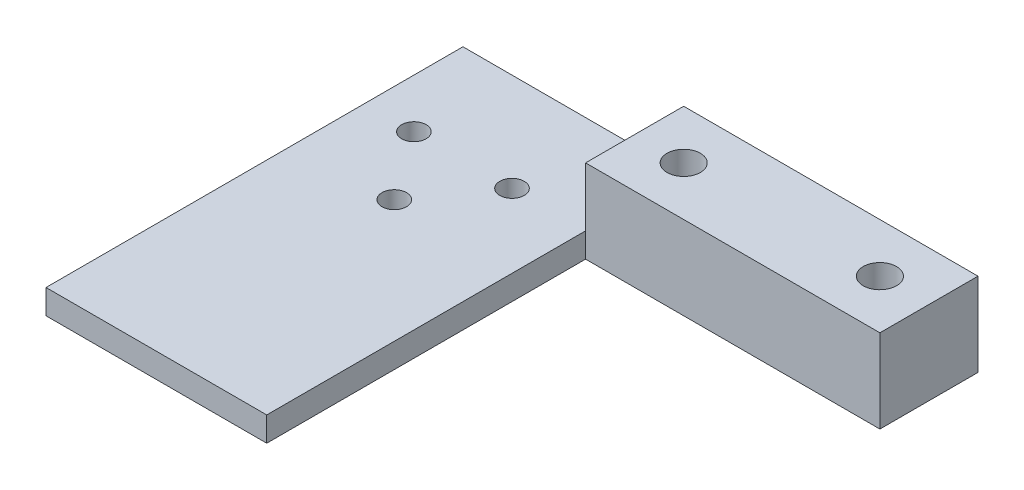
ISO-10303-21;
HEADER;
FILE_DESCRIPTION(('STEP AP214'),'2;1');
FILE_NAME('part.step','',(''),(''),'','','');
FILE_SCHEMA(('AUTOMOTIVE_DESIGN { 1 0 10303 214 1 1 1 1 }'));
ENDSEC;
DATA;
#1=APPLICATION_CONTEXT('core data for automotive mechanical design processes');
#2=APPLICATION_PROTOCOL_DEFINITION('international standard','automotive_design',2000,#1);
#3=PRODUCT_CONTEXT('',#1,'mechanical');
#4=PRODUCT('Part','Part','',(#3));
#5=PRODUCT_RELATED_PRODUCT_CATEGORY('part','',(#4));
#6=PRODUCT_DEFINITION_FORMATION('','',#4);
#7=PRODUCT_DEFINITION_CONTEXT('part definition',#1,'design');
#8=PRODUCT_DEFINITION('design','',#6,#7);
#9=PRODUCT_DEFINITION_SHAPE('','',#8);
#10=(LENGTH_UNIT() NAMED_UNIT(*) SI_UNIT(.MILLI.,.METRE.));
#11=(NAMED_UNIT(*) PLANE_ANGLE_UNIT() SI_UNIT($,.RADIAN.));
#12=(NAMED_UNIT(*) SI_UNIT($,.STERADIAN.) SOLID_ANGLE_UNIT());
#13=UNCERTAINTY_MEASURE_WITH_UNIT(LENGTH_MEASURE(1.E-05),#10,'distance_accuracy_value','');
#14=(GEOMETRIC_REPRESENTATION_CONTEXT(3) GLOBAL_UNCERTAINTY_ASSIGNED_CONTEXT((#13)) GLOBAL_UNIT_ASSIGNED_CONTEXT((#10,
#11,#12)) REPRESENTATION_CONTEXT('',''));
#15=CARTESIAN_POINT('',(0.,0.,0.));
#16=DIRECTION('',(0.,0.,1.));
#17=DIRECTION('',(1.,0.,0.));
#18=AXIS2_PLACEMENT_3D('',#15,#16,#17);
#19=CARTESIAN_POINT('',(-7.49999999999999,17.,42.5));
#20=DIRECTION('',(1.,0.,0.));
#21=DIRECTION('',(0.,0.,-1.));
#22=AXIS2_PLACEMENT_3D('',#19,#20,#21);
#23=PLANE('',#22);
#24=DIRECTION('',(0.,0.,1.));
#25=VECTOR('',#24,1.);
#26=CARTESIAN_POINT('',(-7.50000000000001,5.,0.));
#27=LINE('',#26,#25);
#28=CARTESIAN_POINT('',(-7.50000000000001,5.,-22.5000000000002));
#29=VERTEX_POINT('',#28);
#30=CARTESIAN_POINT('',(-7.50000000000001,5.,-42.5000000000002));
#31=VERTEX_POINT('',#30);
#32=EDGE_CURVE('E253',#29,#31,#27,.F.);
#33=ORIENTED_EDGE('',*,*,#32,.F.);
#34=DIRECTION('',(0.,1.,0.));
#35=VECTOR('',#34,1.);
#36=CARTESIAN_POINT('',(-7.50000000000001,0.,-22.5000000000002));
#37=LINE('',#36,#35);
#38=CARTESIAN_POINT('',(-7.50000000000001,17.,-22.5000000000002));
#39=VERTEX_POINT('',#38);
#40=EDGE_CURVE('E272',#39,#29,#37,.F.);
#41=ORIENTED_EDGE('',*,*,#40,.F.);
#42=DIRECTION('',(0.,0.,1.));
#43=VECTOR('',#42,1.);
#44=CARTESIAN_POINT('',(-7.50000000000001,17.,0.));
#45=LINE('',#44,#43);
#46=CARTESIAN_POINT('',(-7.50000000000001,17.,-42.5000000000002));
#47=VERTEX_POINT('',#46);
#48=EDGE_CURVE('E136',#47,#39,#45,.T.);
#49=ORIENTED_EDGE('',*,*,#48,.F.);
#50=DIRECTION('',(0.,1.,0.));
#51=VECTOR('',#50,1.);
#52=CARTESIAN_POINT('',(-7.50000000000001,0.,-42.5000000000002));
#53=LINE('',#52,#51);
#54=EDGE_CURVE('E279',#31,#47,#53,.T.);
#55=ORIENTED_EDGE('',*,*,#54,.F.);
#56=EDGE_LOOP('',(#33,#41,#49,#55));
#57=FACE_BOUND('',#56,.T.);
#58=ADVANCED_FACE('F16',(#57),#23,.F.);
#59=CARTESIAN_POINT('',(0.,17.,0.));
#60=DIRECTION('',(0.,1.,0.));
#61=DIRECTION('',(0.,0.,1.));
#62=AXIS2_PLACEMENT_3D('',#59,#60,#61);
#63=PLANE('',#62);
#64=CARTESIAN_POINT('',(2.5,17.,-32.5000000000002));
#65=DIRECTION('',(0.,1.,0.));
#66=DIRECTION('',(0.,0.,1.));
#67=AXIS2_PLACEMENT_3D('',#64,#65,#66);
#68=CIRCLE('',#67,3.4);
#69=CARTESIAN_POINT('',(2.5,17.,-29.1000000000002));
#70=VERTEX_POINT('',#69);
#71=EDGE_CURVE('E118',#70,#70,#68,.F.);
#72=ORIENTED_EDGE('',*,*,#71,.T.);
#73=EDGE_LOOP('',(#72));
#74=FACE_BOUND('',#73,.T.);
#75=CARTESIAN_POINT('',(42.5,17.,-32.5000000000002));
#76=DIRECTION('',(0.,1.,0.));
#77=DIRECTION('',(0.,0.,1.));
#78=AXIS2_PLACEMENT_3D('',#75,#76,#77);
#79=CIRCLE('',#78,3.4);
#80=CARTESIAN_POINT('',(42.5,17.,-29.1000000000002));
#81=VERTEX_POINT('',#80);
#82=EDGE_CURVE('E19',#81,#81,#79,.F.);
#83=ORIENTED_EDGE('',*,*,#82,.T.);
#84=EDGE_LOOP('',(#83));
#85=FACE_BOUND('',#84,.T.);
#86=DIRECTION('',(-1.,0.,0.));
#87=VECTOR('',#86,1.);
#88=CARTESIAN_POINT('',(52.5,17.,-42.5));
#89=LINE('',#88,#87);
#90=CARTESIAN_POINT('',(52.5,17.,-42.5));
#91=VERTEX_POINT('',#90);
#92=EDGE_CURVE('E281',#47,#91,#89,.F.);
#93=ORIENTED_EDGE('',*,*,#92,.F.);
#94=ORIENTED_EDGE('',*,*,#48,.T.);
#95=DIRECTION('',(1.,0.,0.));
#96=VECTOR('',#95,1.);
#97=CARTESIAN_POINT('',(-7.50000000000001,17.,-22.5000000000002));
#98=LINE('',#97,#96);
#99=CARTESIAN_POINT('',(52.5,17.,-22.5));
#100=VERTEX_POINT('',#99);
#101=EDGE_CURVE('E269',#100,#39,#98,.F.);
#102=ORIENTED_EDGE('',*,*,#101,.F.);
#103=DIRECTION('',(0.,0.,-1.));
#104=VECTOR('',#103,1.);
#105=CARTESIAN_POINT('',(52.5,17.,-22.5));
#106=LINE('',#105,#104);
#107=EDGE_CURVE('E275',#91,#100,#106,.F.);
#108=ORIENTED_EDGE('',*,*,#107,.F.);
#109=EDGE_LOOP('',(#93,#94,#102,#108));
#110=FACE_BOUND('',#109,.T.);
#111=ADVANCED_FACE('F165',(#74,#85,#110),#63,.T.);
#112=CARTESIAN_POINT('',(42.5,-0.895072409927977,-32.5000000000002));
#113=DIRECTION('',(0.,1.,0.));
#114=DIRECTION('',(0.,0.,1.));
#115=AXIS2_PLACEMENT_3D('',#112,#113,#114);
#116=CYLINDRICAL_SURFACE('',#115,3.4);
#117=CARTESIAN_POINT('',(42.5,2.00000000000955,-32.5000000000002));
#118=DIRECTION('',(0.,1.,0.));
#119=DIRECTION('',(0.,0.,-1.));
#120=AXIS2_PLACEMENT_3D('',#117,#118,#119);
#121=CIRCLE('',#120,3.40000000002647);
#122=CARTESIAN_POINT('',(45.8999999999755,1.99999999998823,-32.5));
#123=VERTEX_POINT('',#122);
#124=CARTESIAN_POINT('',(39.1000000000194,1.99999999999295,-32.5000000000002));
#125=VERTEX_POINT('',#124);
#126=EDGE_CURVE('E122',#123,#125,#121,.F.);
#127=ORIENTED_EDGE('',*,*,#126,.T.);
#128=CARTESIAN_POINT('',(42.5,2.00000000000955,-32.5000000000002));
#129=DIRECTION('',(0.,1.,0.));
#130=DIRECTION('',(0.,0.,1.));
#131=AXIS2_PLACEMENT_3D('',#128,#129,#130);
#132=CIRCLE('',#131,3.39999999991505);
#133=EDGE_CURVE('E111',#125,#123,#132,.F.);
#134=ORIENTED_EDGE('',*,*,#133,.T.);
#135=EDGE_LOOP('',(#127,#134));
#136=FACE_BOUND('',#135,.T.);
#137=ORIENTED_EDGE('',*,*,#82,.F.);
#138=EDGE_LOOP('',(#137));
#139=FACE_BOUND('',#138,.T.);
#140=ADVANCED_FACE('F126',(#136,#139),#116,.F.);
#141=CARTESIAN_POINT('',(42.5,1.99999999995271,-32.5000000000002));
#142=DIRECTION('',(0.,1.,0.));
#143=DIRECTION('',(0.,0.,1.));
#144=AXIS2_PLACEMENT_3D('',#141,#142,#143);
#145=CONICAL_SURFACE('',#144,3.39999999985821,1.02974425867836);
#146=ORIENTED_EDGE('',*,*,#133,.F.);
#147=DIRECTION('',(0.857167300703852,-0.515038074907159,0.));
#148=VECTOR('',#147,1.);
#149=CARTESIAN_POINT('',(-498925.,299809.877996235,-32.5000000000307));
#150=LINE('',#149,#148);
#151=CARTESIAN_POINT('',(42.4285589646399,4.31321645066873E-11,-32.5000000000002));
#152=VERTEX_POINT('',#151);
#153=EDGE_CURVE('E115',#125,#152,#150,.T.);
#154=ORIENTED_EDGE('',*,*,#153,.T.);
#155=CARTESIAN_POINT('',(42.5,5.7065463465733E-11,-32.5000000000002));
#156=DIRECTION('',(0.,1.,0.));
#157=DIRECTION('',(0.,0.,1.));
#158=AXIS2_PLACEMENT_3D('',#155,#156,#157);
#159=CIRCLE('',#158,0.0714410353180039);
#160=CARTESIAN_POINT('',(42.5714410353316,4.31321645066873E-11,-32.5000000000002));
#161=VERTEX_POINT('',#160);
#162=EDGE_CURVE('E46',#161,#152,#159,.T.);
#163=ORIENTED_EDGE('',*,*,#162,.F.);
#164=DIRECTION('',(-0.857167300703852,-0.515038074907159,0.));
#165=VECTOR('',#164,1.);
#166=CARTESIAN_POINT('',(499010.,299809.877996235,-32.4999999999085));
#167=LINE('',#166,#165);
#168=EDGE_CURVE('E117',#161,#123,#167,.F.);
#169=ORIENTED_EDGE('',*,*,#168,.T.);
#170=EDGE_LOOP('',(#146,#154,#163,#169));
#171=FACE_BOUND('',#170,.T.);
#172=ADVANCED_FACE('F114',(#171),#145,.F.);
#173=CARTESIAN_POINT('',(2.5,-0.895072409927977,-32.5000000000002));
#174=DIRECTION('',(0.,1.,0.));
#175=DIRECTION('',(0.,0.,1.));
#176=AXIS2_PLACEMENT_3D('',#173,#174,#175);
#177=CYLINDRICAL_SURFACE('',#176,3.4);
#178=CARTESIAN_POINT('',(2.5,2.00000000000955,-32.5000000000002));
#179=DIRECTION('',(0.,1.,0.));
#180=DIRECTION('',(0.,0.,-1.));
#181=AXIS2_PLACEMENT_3D('',#178,#179,#180);
#182=CIRCLE('',#181,3.40000000002647);
#183=CARTESIAN_POINT('',(5.89999999998461,1.99999999998823,-32.5000000000002));
#184=VERTEX_POINT('',#183);
#185=CARTESIAN_POINT('',(-0.899999999971535,1.99999999999295,-32.5000000000002));
#186=VERTEX_POINT('',#185);
#187=EDGE_CURVE('E241',#184,#186,#182,.F.);
#188=ORIENTED_EDGE('',*,*,#187,.T.);
#189=CARTESIAN_POINT('',(2.5,2.00000000000955,-32.5000000000002));
#190=DIRECTION('',(0.,1.,0.));
#191=DIRECTION('',(0.,0.,1.));
#192=AXIS2_PLACEMENT_3D('',#189,#190,#191);
#193=CIRCLE('',#192,3.39999999991505);
#194=EDGE_CURVE('E160',#186,#184,#193,.F.);
#195=ORIENTED_EDGE('',*,*,#194,.T.);
#196=EDGE_LOOP('',(#188,#195));
#197=FACE_BOUND('',#196,.T.);
#198=ORIENTED_EDGE('',*,*,#71,.F.);
#199=EDGE_LOOP('',(#198));
#200=FACE_BOUND('',#199,.T.);
#201=ADVANCED_FACE('F174',(#197,#200),#177,.F.);
#202=CARTESIAN_POINT('',(2.5,1.99999999995271,-32.5000000000002));
#203=DIRECTION('',(0.,1.,0.));
#204=DIRECTION('',(0.,0.,1.));
#205=AXIS2_PLACEMENT_3D('',#202,#203,#204);
#206=CONICAL_SURFACE('',#205,3.39999999985821,1.02974425867836);
#207=ORIENTED_EDGE('',*,*,#194,.F.);
#208=DIRECTION('',(0.857167300703852,-0.515038074907159,0.));
#209=VECTOR('',#208,1.);
#210=CARTESIAN_POINT('',(-498965.,299809.877996235,-32.5000000000307));
#211=LINE('',#210,#209);
#212=CARTESIAN_POINT('',(2.42855896471156,2.60902410786912E-11,-32.5000000000002));
#213=VERTEX_POINT('',#212);
#214=EDGE_CURVE('E158',#186,#213,#211,.T.);
#215=ORIENTED_EDGE('',*,*,#214,.T.);
#216=CARTESIAN_POINT('',(2.5,5.7065463465733E-11,-32.5000000000002));
#217=DIRECTION('',(0.,1.,0.));
#218=DIRECTION('',(0.,0.,1.));
#219=AXIS2_PLACEMENT_3D('',#216,#217,#218);
#220=CIRCLE('',#219,0.0714410353180039);
#221=CARTESIAN_POINT('',(2.57144103534529,2.60902410786912E-11,-32.5000000000002));
#222=VERTEX_POINT('',#221);
#223=EDGE_CURVE('E34',#222,#213,#220,.T.);
#224=ORIENTED_EDGE('',*,*,#223,.F.);
#225=DIRECTION('',(-0.857167300703852,-0.515038074907159,0.));
#226=VECTOR('',#225,1.);
#227=CARTESIAN_POINT('',(498970.,299809.877996235,-32.4999999999085));
#228=LINE('',#227,#226);
#229=EDGE_CURVE('E124',#222,#184,#228,.F.);
#230=ORIENTED_EDGE('',*,*,#229,.T.);
#231=EDGE_LOOP('',(#207,#215,#224,#230));
#232=FACE_BOUND('',#231,.T.);
#233=ADVANCED_FACE('F230',(#232),#206,.F.);
#234=CARTESIAN_POINT('',(0.,5.,0.));
#235=DIRECTION('',(0.,1.,0.));
#236=DIRECTION('',(0.,0.,1.));
#237=AXIS2_PLACEMENT_3D('',#234,#235,#236);
#238=PLANE('',#237);
#239=CARTESIAN_POINT('',(-32.5,5.,-8.5000000000002));
#240=DIRECTION('',(0.,-1.,0.));
#241=DIRECTION('',(0.,0.,-1.));
#242=AXIS2_PLACEMENT_3D('',#239,#240,#241);
#243=CIRCLE('',#242,2.5);
#244=CARTESIAN_POINT('',(-32.5,5.,-11.0000000000002));
#245=VERTEX_POINT('',#244);
#246=EDGE_CURVE('E148',#245,#245,#243,.T.);
#247=ORIENTED_EDGE('',*,*,#246,.T.);
#248=EDGE_LOOP('',(#247));
#249=FACE_BOUND('',#248,.T.);
#250=CARTESIAN_POINT('',(-42.5,5.,-22.5));
#251=DIRECTION('',(0.,1.,0.));
#252=DIRECTION('',(0.,0.,1.));
#253=AXIS2_PLACEMENT_3D('',#250,#251,#252);
#254=CIRCLE('',#253,2.5);
#255=CARTESIAN_POINT('',(-42.5,5.,-20.));
#256=VERTEX_POINT('',#255);
#257=EDGE_CURVE('E152',#256,#256,#254,.F.);
#258=ORIENTED_EDGE('',*,*,#257,.T.);
#259=EDGE_LOOP('',(#258));
#260=FACE_BOUND('',#259,.T.);
#261=CARTESIAN_POINT('',(-22.5,5.,-22.5000000000002));
#262=DIRECTION('',(0.,1.,0.));
#263=DIRECTION('',(0.,0.,1.));
#264=AXIS2_PLACEMENT_3D('',#261,#262,#263);
#265=CIRCLE('',#264,2.5);
#266=CARTESIAN_POINT('',(-22.5,5.,-20.0000000000002));
#267=VERTEX_POINT('',#266);
#268=EDGE_CURVE('E155',#267,#267,#265,.F.);
#269=ORIENTED_EDGE('',*,*,#268,.T.);
#270=EDGE_LOOP('',(#269));
#271=FACE_BOUND('',#270,.T.);
#272=DIRECTION('',(-1.,0.,0.));
#273=VECTOR('',#272,1.);
#274=CARTESIAN_POINT('',(52.5,5.,-42.5));
#275=LINE('',#274,#273);
#276=CARTESIAN_POINT('',(-52.5,5.,-42.5000000000004));
#277=VERTEX_POINT('',#276);
#278=EDGE_CURVE('E129',#277,#31,#275,.F.);
#279=ORIENTED_EDGE('',*,*,#278,.F.);
#280=DIRECTION('',(0.,0.,1.));
#281=VECTOR('',#280,1.);
#282=CARTESIAN_POINT('',(-52.5,5.,-42.5000000000004));
#283=LINE('',#282,#281);
#284=CARTESIAN_POINT('',(-52.5,5.,42.4999999999996));
#285=VERTEX_POINT('',#284);
#286=EDGE_CURVE('E255',#285,#277,#283,.F.);
#287=ORIENTED_EDGE('',*,*,#286,.F.);
#288=DIRECTION('',(1.,0.,0.));
#289=VECTOR('',#288,1.);
#290=CARTESIAN_POINT('',(-52.5,5.,42.4999999999996));
#291=LINE('',#290,#289);
#292=CARTESIAN_POINT('',(-7.49999999999999,5.,42.5));
#293=VERTEX_POINT('',#292);
#294=EDGE_CURVE('E259',#293,#285,#291,.F.);
#295=ORIENTED_EDGE('',*,*,#294,.F.);
#296=DIRECTION('',(0.,0.,-1.));
#297=VECTOR('',#296,1.);
#298=CARTESIAN_POINT('',(-7.49999999999999,5.,42.5));
#299=LINE('',#298,#297);
#300=EDGE_CURVE('E264',#29,#293,#299,.F.);
#301=ORIENTED_EDGE('',*,*,#300,.F.);
#302=ORIENTED_EDGE('',*,*,#32,.T.);
#303=EDGE_LOOP('',(#279,#287,#295,#301,#302));
#304=FACE_BOUND('',#303,.T.);
#305=ADVANCED_FACE('F226',(#249,#260,#271,#304),#238,.T.);
#306=CARTESIAN_POINT('',(-52.5,0.,-42.5000000000004));
#307=DIRECTION('',(-1.,0.,0.));
#308=DIRECTION('',(0.,0.,1.));
#309=AXIS2_PLACEMENT_3D('',#306,#307,#308);
#310=PLANE('',#309);
#311=DIRECTION('',(0.,1.,0.));
#312=VECTOR('',#311,1.);
#313=CARTESIAN_POINT('',(-52.5,0.,42.4999999999996));
#314=LINE('',#313,#312);
#315=CARTESIAN_POINT('',(-52.5,0.,42.4999999999996));
#316=VERTEX_POINT('',#315);
#317=EDGE_CURVE('E257',#285,#316,#314,.F.);
#318=ORIENTED_EDGE('',*,*,#317,.F.);
#319=ORIENTED_EDGE('',*,*,#286,.T.);
#320=DIRECTION('',(0.,1.,0.));
#321=VECTOR('',#320,1.);
#322=CARTESIAN_POINT('',(-52.5,0.,-42.5000000000004));
#323=LINE('',#322,#321);
#324=CARTESIAN_POINT('',(-52.5,0.,-42.5000000000004));
#325=VERTEX_POINT('',#324);
#326=EDGE_CURVE('E284',#325,#277,#323,.T.);
#327=ORIENTED_EDGE('',*,*,#326,.F.);
#328=DIRECTION('',(0.,0.,1.));
#329=VECTOR('',#328,1.);
#330=CARTESIAN_POINT('',(-52.5,0.,-3.88578058618805E-13));
#331=LINE('',#330,#329);
#332=EDGE_CURVE('E151',#325,#316,#331,.T.);
#333=ORIENTED_EDGE('',*,*,#332,.T.);
#334=EDGE_LOOP('',(#318,#319,#327,#333));
#335=FACE_BOUND('',#334,.T.);
#336=ADVANCED_FACE('F222',(#335),#310,.T.);
#337=CARTESIAN_POINT('',(-52.5,0.,42.4999999999996));
#338=DIRECTION('',(0.,0.,1.));
#339=DIRECTION('',(1.,0.,0.));
#340=AXIS2_PLACEMENT_3D('',#337,#338,#339);
#341=PLANE('',#340);
#342=DIRECTION('',(0.,1.,0.));
#343=VECTOR('',#342,1.);
#344=CARTESIAN_POINT('',(-7.49999999999999,0.,42.5));
#345=LINE('',#344,#343);
#346=CARTESIAN_POINT('',(-7.49999999999999,0.,42.5));
#347=VERTEX_POINT('',#346);
#348=EDGE_CURVE('E262',#293,#347,#345,.F.);
#349=ORIENTED_EDGE('',*,*,#348,.F.);
#350=ORIENTED_EDGE('',*,*,#294,.T.);
#351=ORIENTED_EDGE('',*,*,#317,.T.);
#352=DIRECTION('',(1.,0.,0.));
#353=VECTOR('',#352,1.);
#354=CARTESIAN_POINT('',(0.,0.,42.5));
#355=LINE('',#354,#353);
#356=EDGE_CURVE('E299',#316,#347,#355,.T.);
#357=ORIENTED_EDGE('',*,*,#356,.T.);
#358=EDGE_LOOP('',(#349,#350,#351,#357));
#359=FACE_BOUND('',#358,.T.);
#360=ADVANCED_FACE('F218',(#359),#341,.T.);
#361=CARTESIAN_POINT('',(-7.49999999999999,0.,42.5));
#362=DIRECTION('',(1.,0.,0.));
#363=DIRECTION('',(0.,0.,-1.));
#364=AXIS2_PLACEMENT_3D('',#361,#362,#363);
#365=PLANE('',#364);
#366=DIRECTION('',(0.,1.,0.));
#367=VECTOR('',#366,1.);
#368=CARTESIAN_POINT('',(-7.50000000000001,0.,-22.5000000000002));
#369=LINE('',#368,#367);
#370=CARTESIAN_POINT('',(-7.50000000000001,0.,-22.5000000000002));
#371=VERTEX_POINT('',#370);
#372=EDGE_CURVE('E267',#29,#371,#369,.F.);
#373=ORIENTED_EDGE('',*,*,#372,.F.);
#374=ORIENTED_EDGE('',*,*,#300,.T.);
#375=ORIENTED_EDGE('',*,*,#348,.T.);
#376=DIRECTION('',(0.,0.,1.));
#377=VECTOR('',#376,1.);
#378=CARTESIAN_POINT('',(-7.50000000000001,0.,0.));
#379=LINE('',#378,#377);
#380=EDGE_CURVE('E302',#347,#371,#379,.F.);
#381=ORIENTED_EDGE('',*,*,#380,.T.);
#382=EDGE_LOOP('',(#373,#374,#375,#381));
#383=FACE_BOUND('',#382,.T.);
#384=ADVANCED_FACE('F214',(#383),#365,.T.);
#385=CARTESIAN_POINT('',(-7.50000000000001,0.,-22.5000000000002));
#386=DIRECTION('',(0.,0.,1.));
#387=DIRECTION('',(1.,0.,0.));
#388=AXIS2_PLACEMENT_3D('',#385,#386,#387);
#389=PLANE('',#388);
#390=ORIENTED_EDGE('',*,*,#101,.T.);
#391=ORIENTED_EDGE('',*,*,#40,.T.);
#392=ORIENTED_EDGE('',*,*,#372,.T.);
#393=DIRECTION('',(1.,0.,0.));
#394=VECTOR('',#393,1.);
#395=CARTESIAN_POINT('',(0.,0.,-22.5000000000002));
#396=LINE('',#395,#394);
#397=CARTESIAN_POINT('',(52.5,0.,-22.5));
#398=VERTEX_POINT('',#397);
#399=EDGE_CURVE('E305',#371,#398,#396,.T.);
#400=ORIENTED_EDGE('',*,*,#399,.T.);
#401=DIRECTION('',(0.,1.,0.));
#402=VECTOR('',#401,1.);
#403=CARTESIAN_POINT('',(52.5,0.,-22.5));
#404=LINE('',#403,#402);
#405=EDGE_CURVE('E277',#100,#398,#404,.F.);
#406=ORIENTED_EDGE('',*,*,#405,.F.);
#407=EDGE_LOOP('',(#390,#391,#392,#400,#406));
#408=FACE_BOUND('',#407,.T.);
#409=ADVANCED_FACE('F210',(#408),#389,.T.);
#410=CARTESIAN_POINT('',(52.5,0.,-22.5));
#411=DIRECTION('',(1.,0.,0.));
#412=DIRECTION('',(0.,0.,-1.));
#413=AXIS2_PLACEMENT_3D('',#410,#411,#412);
#414=PLANE('',#413);
#415=ORIENTED_EDGE('',*,*,#405,.T.);
#416=DIRECTION('',(0.,0.,1.));
#417=VECTOR('',#416,1.);
#418=CARTESIAN_POINT('',(52.4999999999998,0.,0.));
#419=LINE('',#418,#417);
#420=CARTESIAN_POINT('',(52.5,0.,-42.5));
#421=VERTEX_POINT('',#420);
#422=EDGE_CURVE('E308',#398,#421,#419,.F.);
#423=ORIENTED_EDGE('',*,*,#422,.T.);
#424=DIRECTION('',(0.,1.,0.));
#425=VECTOR('',#424,1.);
#426=CARTESIAN_POINT('',(52.5,0.,-42.5));
#427=LINE('',#426,#425);
#428=EDGE_CURVE('E58',#91,#421,#427,.F.);
#429=ORIENTED_EDGE('',*,*,#428,.F.);
#430=ORIENTED_EDGE('',*,*,#107,.T.);
#431=EDGE_LOOP('',(#415,#423,#429,#430));
#432=FACE_BOUND('',#431,.T.);
#433=ADVANCED_FACE('F207',(#432),#414,.T.);
#434=CARTESIAN_POINT('',(52.5,0.,-42.5));
#435=DIRECTION('',(0.,0.,-1.));
#436=DIRECTION('',(-1.,0.,0.));
#437=AXIS2_PLACEMENT_3D('',#434,#435,#436);
#438=PLANE('',#437);
#439=ORIENTED_EDGE('',*,*,#326,.T.);
#440=ORIENTED_EDGE('',*,*,#278,.T.);
#441=ORIENTED_EDGE('',*,*,#54,.T.);
#442=ORIENTED_EDGE('',*,*,#92,.T.);
#443=ORIENTED_EDGE('',*,*,#428,.T.);
#444=DIRECTION('',(1.,0.,0.));
#445=VECTOR('',#444,1.);
#446=CARTESIAN_POINT('',(0.,0.,-42.5000000000002));
#447=LINE('',#446,#445);
#448=EDGE_CURVE('E147',#421,#325,#447,.F.);
#449=ORIENTED_EDGE('',*,*,#448,.T.);
#450=EDGE_LOOP('',(#439,#440,#441,#442,#443,#449));
#451=FACE_BOUND('',#450,.T.);
#452=ADVANCED_FACE('F204',(#451),#438,.T.);
#453=CARTESIAN_POINT('',(42.5,1.99999999995271,-32.5000000000002));
#454=DIRECTION('',(0.,1.,0.));
#455=DIRECTION('',(0.,0.,1.));
#456=AXIS2_PLACEMENT_3D('',#453,#454,#455);
#457=CONICAL_SURFACE('',#456,3.39999999996962,1.02974425869091);
#458=ORIENTED_EDGE('',*,*,#126,.F.);
#459=ORIENTED_EDGE('',*,*,#168,.F.);
#460=CARTESIAN_POINT('',(42.5,2.92543766988729E-11,-32.5000000000002));
#461=DIRECTION('',(0.,1.,0.));
#462=DIRECTION('',(0.,0.,1.));
#463=AXIS2_PLACEMENT_3D('',#460,#461,#462);
#464=CIRCLE('',#463,0.0714410352884443);
#465=EDGE_CURVE('E123',#161,#152,#464,.F.);
#466=ORIENTED_EDGE('',*,*,#465,.T.);
#467=ORIENTED_EDGE('',*,*,#153,.F.);
#468=EDGE_LOOP('',(#458,#459,#466,#467));
#469=FACE_BOUND('',#468,.T.);
#470=ADVANCED_FACE('F121',(#469),#457,.F.);
#471=CARTESIAN_POINT('',(2.5,1.99999999995271,-32.5000000000002));
#472=DIRECTION('',(0.,1.,0.));
#473=DIRECTION('',(0.,0.,1.));
#474=AXIS2_PLACEMENT_3D('',#471,#472,#473);
#475=CONICAL_SURFACE('',#474,3.39999999996962,1.02974425869091);
#476=ORIENTED_EDGE('',*,*,#187,.F.);
#477=ORIENTED_EDGE('',*,*,#229,.F.);
#478=CARTESIAN_POINT('',(2.5,-4.94049245958195E-12,-32.5000000000002));
#479=DIRECTION('',(0.,1.,0.));
#480=DIRECTION('',(0.,0.,1.));
#481=AXIS2_PLACEMENT_3D('',#478,#479,#480);
#482=CIRCLE('',#481,0.0714410352316008);
#483=EDGE_CURVE('E143',#222,#213,#482,.F.);
#484=ORIENTED_EDGE('',*,*,#483,.T.);
#485=ORIENTED_EDGE('',*,*,#214,.F.);
#486=EDGE_LOOP('',(#476,#477,#484,#485));
#487=FACE_BOUND('',#486,.T.);
#488=ADVANCED_FACE('F197',(#487),#475,.F.);
#489=CARTESIAN_POINT('',(-22.5,-7.07725912495,-22.5000000000002));
#490=DIRECTION('',(0.,1.,0.));
#491=DIRECTION('',(0.,0.,1.));
#492=AXIS2_PLACEMENT_3D('',#489,#490,#491);
#493=CYLINDRICAL_SURFACE('',#492,2.5);
#494=ORIENTED_EDGE('',*,*,#268,.F.);
#495=EDGE_LOOP('',(#494));
#496=FACE_BOUND('',#495,.T.);
#497=CARTESIAN_POINT('',(-22.5,0.,-22.5000000000002));
#498=DIRECTION('',(0.,1.,0.));
#499=DIRECTION('',(0.,0.,1.));
#500=AXIS2_PLACEMENT_3D('',#497,#498,#499);
#501=CIRCLE('',#500,2.5);
#502=CARTESIAN_POINT('',(-22.5,0.,-20.0000000000002));
#503=VERTEX_POINT('',#502);
#504=EDGE_CURVE('E140',#503,#503,#501,.F.);
#505=ORIENTED_EDGE('',*,*,#504,.T.);
#506=EDGE_LOOP('',(#505));
#507=FACE_BOUND('',#506,.T.);
#508=ADVANCED_FACE('F193',(#496,#507),#493,.F.);
#509=CARTESIAN_POINT('',(-42.5,-7.07725912495,-22.5));
#510=DIRECTION('',(0.,1.,0.));
#511=DIRECTION('',(0.,0.,1.));
#512=AXIS2_PLACEMENT_3D('',#509,#510,#511);
#513=CYLINDRICAL_SURFACE('',#512,2.5);
#514=ORIENTED_EDGE('',*,*,#257,.F.);
#515=EDGE_LOOP('',(#514));
#516=FACE_BOUND('',#515,.T.);
#517=CARTESIAN_POINT('',(-42.5,0.,-22.5));
#518=DIRECTION('',(0.,1.,0.));
#519=DIRECTION('',(0.,0.,1.));
#520=AXIS2_PLACEMENT_3D('',#517,#518,#519);
#521=CIRCLE('',#520,2.5);
#522=CARTESIAN_POINT('',(-42.5,0.,-20.));
#523=VERTEX_POINT('',#522);
#524=EDGE_CURVE('E25',#523,#523,#521,.F.);
#525=ORIENTED_EDGE('',*,*,#524,.T.);
#526=EDGE_LOOP('',(#525));
#527=FACE_BOUND('',#526,.T.);
#528=ADVANCED_FACE('F185',(#516,#527),#513,.F.);
#529=CARTESIAN_POINT('',(-32.5,15.,-8.5000000000002));
#530=DIRECTION('',(0.,-1.,0.));
#531=DIRECTION('',(0.,0.,-1.));
#532=AXIS2_PLACEMENT_3D('',#529,#530,#531);
#533=CYLINDRICAL_SURFACE('',#532,2.5);
#534=CARTESIAN_POINT('',(-32.5,0.,-8.5000000000002));
#535=DIRECTION('',(0.,-1.,0.));
#536=DIRECTION('',(0.,0.,-1.));
#537=AXIS2_PLACEMENT_3D('',#534,#535,#536);
#538=CIRCLE('',#537,2.5);
#539=CARTESIAN_POINT('',(-32.5,0.,-11.0000000000002));
#540=VERTEX_POINT('',#539);
#541=EDGE_CURVE('E11',#540,#540,#538,.T.);
#542=ORIENTED_EDGE('',*,*,#541,.T.);
#543=EDGE_LOOP('',(#542));
#544=FACE_BOUND('',#543,.T.);
#545=ORIENTED_EDGE('',*,*,#246,.F.);
#546=EDGE_LOOP('',(#545));
#547=FACE_BOUND('',#546,.T.);
#548=ADVANCED_FACE('F179',(#544,#547),#533,.F.);
#549=CARTESIAN_POINT('',(0.,0.,0.));
#550=DIRECTION('',(0.,1.,0.));
#551=DIRECTION('',(0.,0.,1.));
#552=AXIS2_PLACEMENT_3D('',#549,#550,#551);
#553=PLANE('',#552);
#554=ORIENTED_EDGE('',*,*,#541,.F.);
#555=EDGE_LOOP('',(#554));
#556=FACE_BOUND('',#555,.T.);
#557=ORIENTED_EDGE('',*,*,#524,.F.);
#558=EDGE_LOOP('',(#557));
#559=FACE_BOUND('',#558,.T.);
#560=ORIENTED_EDGE('',*,*,#504,.F.);
#561=EDGE_LOOP('',(#560));
#562=FACE_BOUND('',#561,.T.);
#563=ORIENTED_EDGE('',*,*,#223,.T.);
#564=ORIENTED_EDGE('',*,*,#483,.F.);
#565=EDGE_LOOP('',(#563,#564));
#566=FACE_BOUND('',#565,.T.);
#567=ORIENTED_EDGE('',*,*,#162,.T.);
#568=ORIENTED_EDGE('',*,*,#465,.F.);
#569=EDGE_LOOP('',(#567,#568));
#570=FACE_BOUND('',#569,.T.);
#571=ORIENTED_EDGE('',*,*,#422,.F.);
#572=ORIENTED_EDGE('',*,*,#399,.F.);
#573=ORIENTED_EDGE('',*,*,#380,.F.);
#574=ORIENTED_EDGE('',*,*,#356,.F.);
#575=ORIENTED_EDGE('',*,*,#332,.F.);
#576=ORIENTED_EDGE('',*,*,#448,.F.);
#577=EDGE_LOOP('',(#571,#572,#573,#574,#575,#576));
#578=FACE_BOUND('',#577,.T.);
#579=ADVANCED_FACE('F177',(#556,#559,#562,#566,#570,#578),#553,.F.);
#580=CLOSED_SHELL('',(#58,#111,#140,#172,#201,#233,#305,#336,#360,#384,#409,#433,#452,#470,#488,
#508,#528,#548,#579));
#581=MANIFOLD_SOLID_BREP('B1',#580);
#582=ADVANCED_BREP_SHAPE_REPRESENTATION('',(#18,#581),#14);
#583=SHAPE_DEFINITION_REPRESENTATION(#9,#582);
ENDSEC;
END-ISO-10303-21;
